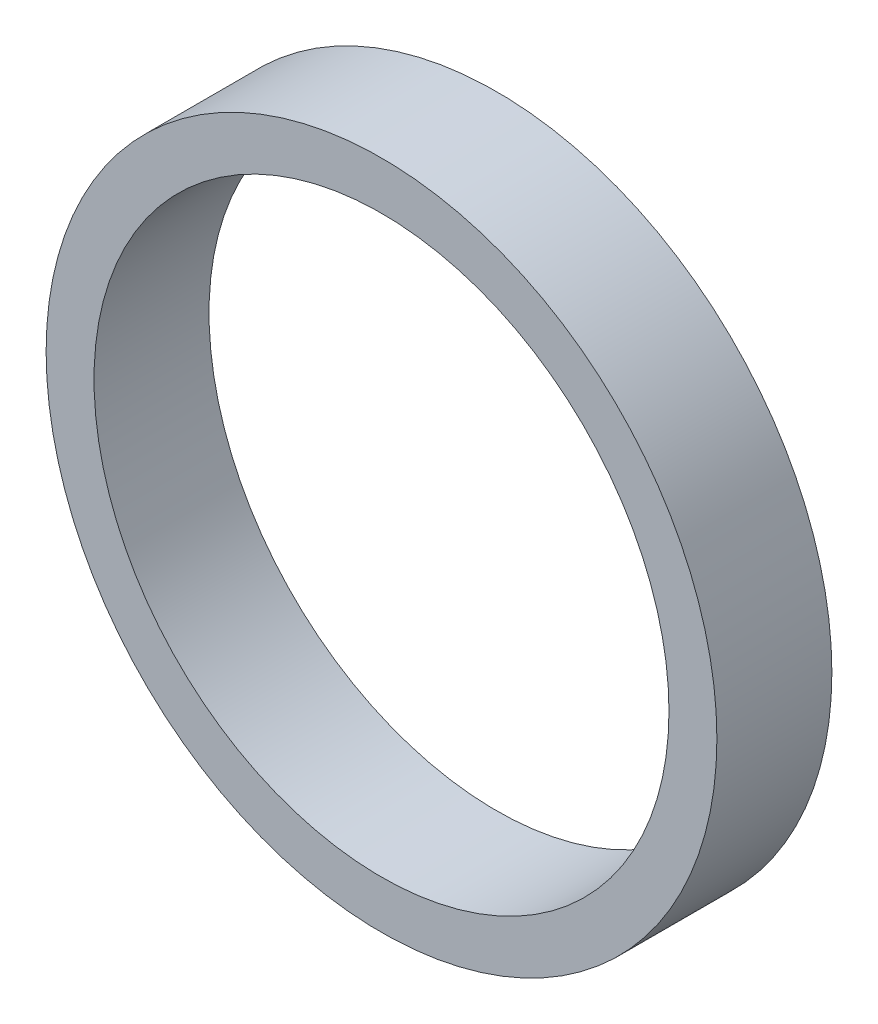
ISO-10303-21;
HEADER;
FILE_DESCRIPTION(('STEP AP214'),'2;1');
FILE_NAME('part.step','',(''),(''),'','','');
FILE_SCHEMA(('AUTOMOTIVE_DESIGN { 1 0 10303 214 1 1 1 1 }'));
ENDSEC;
DATA;
#1=APPLICATION_CONTEXT('core data for automotive mechanical design processes');
#2=APPLICATION_PROTOCOL_DEFINITION('international standard','automotive_design',2000,#1);
#3=PRODUCT_CONTEXT('',#1,'mechanical');
#4=PRODUCT('Part','Part','',(#3));
#5=PRODUCT_RELATED_PRODUCT_CATEGORY('part','',(#4));
#6=PRODUCT_DEFINITION_FORMATION('','',#4);
#7=PRODUCT_DEFINITION_CONTEXT('part definition',#1,'design');
#8=PRODUCT_DEFINITION('design','',#6,#7);
#9=PRODUCT_DEFINITION_SHAPE('','',#8);
#10=(LENGTH_UNIT() NAMED_UNIT(*) SI_UNIT(.MILLI.,.METRE.));
#11=(NAMED_UNIT(*) PLANE_ANGLE_UNIT() SI_UNIT($,.RADIAN.));
#12=(NAMED_UNIT(*) SI_UNIT($,.STERADIAN.) SOLID_ANGLE_UNIT());
#13=UNCERTAINTY_MEASURE_WITH_UNIT(LENGTH_MEASURE(1.E-05),#10,'distance_accuracy_value','');
#14=(GEOMETRIC_REPRESENTATION_CONTEXT(3) GLOBAL_UNCERTAINTY_ASSIGNED_CONTEXT((#13)) GLOBAL_UNIT_ASSIGNED_CONTEXT((#10,
#11,#12)) REPRESENTATION_CONTEXT('',''));
#15=CARTESIAN_POINT('',(0.,0.,0.));
#16=DIRECTION('',(0.,0.,1.));
#17=DIRECTION('',(1.,0.,0.));
#18=AXIS2_PLACEMENT_3D('',#15,#16,#17);
#19=CARTESIAN_POINT('',(0.,0.,6.));
#20=DIRECTION('',(0.,0.,1.));
#21=DIRECTION('',(1.,0.,0.));
#22=AXIS2_PLACEMENT_3D('',#19,#20,#21);
#23=PLANE('',#22);
#24=CARTESIAN_POINT('',(0.,0.,6.));
#25=DIRECTION('',(0.,0.,1.));
#26=DIRECTION('',(1.,0.,0.));
#27=AXIS2_PLACEMENT_3D('',#24,#25,#26);
#28=CIRCLE('',#27,17.5);
#29=CARTESIAN_POINT('',(17.5,0.,6.));
#30=VERTEX_POINT('',#29);
#31=EDGE_CURVE('E10',#30,#30,#28,.T.);
#32=ORIENTED_EDGE('',*,*,#31,.T.);
#33=EDGE_LOOP('',(#32));
#34=FACE_BOUND('',#33,.T.);
#35=CARTESIAN_POINT('',(0.,0.,6.));
#36=DIRECTION('',(0.,0.,1.));
#37=DIRECTION('',(1.,0.,0.));
#38=AXIS2_PLACEMENT_3D('',#35,#36,#37);
#39=CIRCLE('',#38,15.);
#40=CARTESIAN_POINT('',(15.,0.,6.));
#41=VERTEX_POINT('',#40);
#42=EDGE_CURVE('E42',#41,#41,#39,.T.);
#43=ORIENTED_EDGE('',*,*,#42,.F.);
#44=EDGE_LOOP('',(#43));
#45=FACE_BOUND('',#44,.T.);
#46=ADVANCED_FACE('F31',(#34,#45),#23,.T.);
#47=CARTESIAN_POINT('',(0.,0.,0.));
#48=DIRECTION('',(0.,0.,1.));
#49=DIRECTION('',(1.,0.,0.));
#50=AXIS2_PLACEMENT_3D('',#47,#48,#49);
#51=PLANE('',#50);
#52=CARTESIAN_POINT('',(0.,0.,0.));
#53=DIRECTION('',(0.,0.,1.));
#54=DIRECTION('',(1.,0.,0.));
#55=AXIS2_PLACEMENT_3D('',#52,#53,#54);
#56=CIRCLE('',#55,17.5);
#57=CARTESIAN_POINT('',(17.5,0.,0.));
#58=VERTEX_POINT('',#57);
#59=EDGE_CURVE('E35',#58,#58,#56,.T.);
#60=ORIENTED_EDGE('',*,*,#59,.F.);
#61=EDGE_LOOP('',(#60));
#62=FACE_BOUND('',#61,.T.);
#63=CARTESIAN_POINT('',(0.,0.,0.));
#64=DIRECTION('',(0.,0.,1.));
#65=DIRECTION('',(1.,0.,0.));
#66=AXIS2_PLACEMENT_3D('',#63,#64,#65);
#67=CIRCLE('',#66,15.);
#68=CARTESIAN_POINT('',(15.,0.,0.));
#69=VERTEX_POINT('',#68);
#70=EDGE_CURVE('E44',#69,#69,#67,.T.);
#71=ORIENTED_EDGE('',*,*,#70,.T.);
#72=EDGE_LOOP('',(#71));
#73=FACE_BOUND('',#72,.T.);
#74=ADVANCED_FACE('F54',(#62,#73),#51,.F.);
#75=CARTESIAN_POINT('',(0.,0.,6.));
#76=DIRECTION('',(0.,0.,-1.));
#77=DIRECTION('',(-1.,0.,0.));
#78=AXIS2_PLACEMENT_3D('',#75,#76,#77);
#79=CYLINDRICAL_SURFACE('',#78,17.5);
#80=ORIENTED_EDGE('',*,*,#31,.F.);
#81=EDGE_LOOP('',(#80));
#82=FACE_BOUND('',#81,.T.);
#83=ORIENTED_EDGE('',*,*,#59,.T.);
#84=EDGE_LOOP('',(#83));
#85=FACE_BOUND('',#84,.T.);
#86=ADVANCED_FACE('F33',(#82,#85),#79,.T.);
#87=CARTESIAN_POINT('',(0.,0.,6.));
#88=DIRECTION('',(0.,0.,-1.));
#89=DIRECTION('',(-1.,0.,0.));
#90=AXIS2_PLACEMENT_3D('',#87,#88,#89);
#91=CYLINDRICAL_SURFACE('',#90,15.);
#92=ORIENTED_EDGE('',*,*,#42,.T.);
#93=EDGE_LOOP('',(#92));
#94=FACE_BOUND('',#93,.T.);
#95=ORIENTED_EDGE('',*,*,#70,.F.);
#96=EDGE_LOOP('',(#95));
#97=FACE_BOUND('',#96,.T.);
#98=ADVANCED_FACE('F50',(#94,#97),#91,.F.);
#99=CLOSED_SHELL('',(#46,#74,#86,#98));
#100=MANIFOLD_SOLID_BREP('B2',#99);
#101=ADVANCED_BREP_SHAPE_REPRESENTATION('',(#18,#100),#14);
#102=SHAPE_DEFINITION_REPRESENTATION(#9,#101);
ENDSEC;
END-ISO-10303-21;
